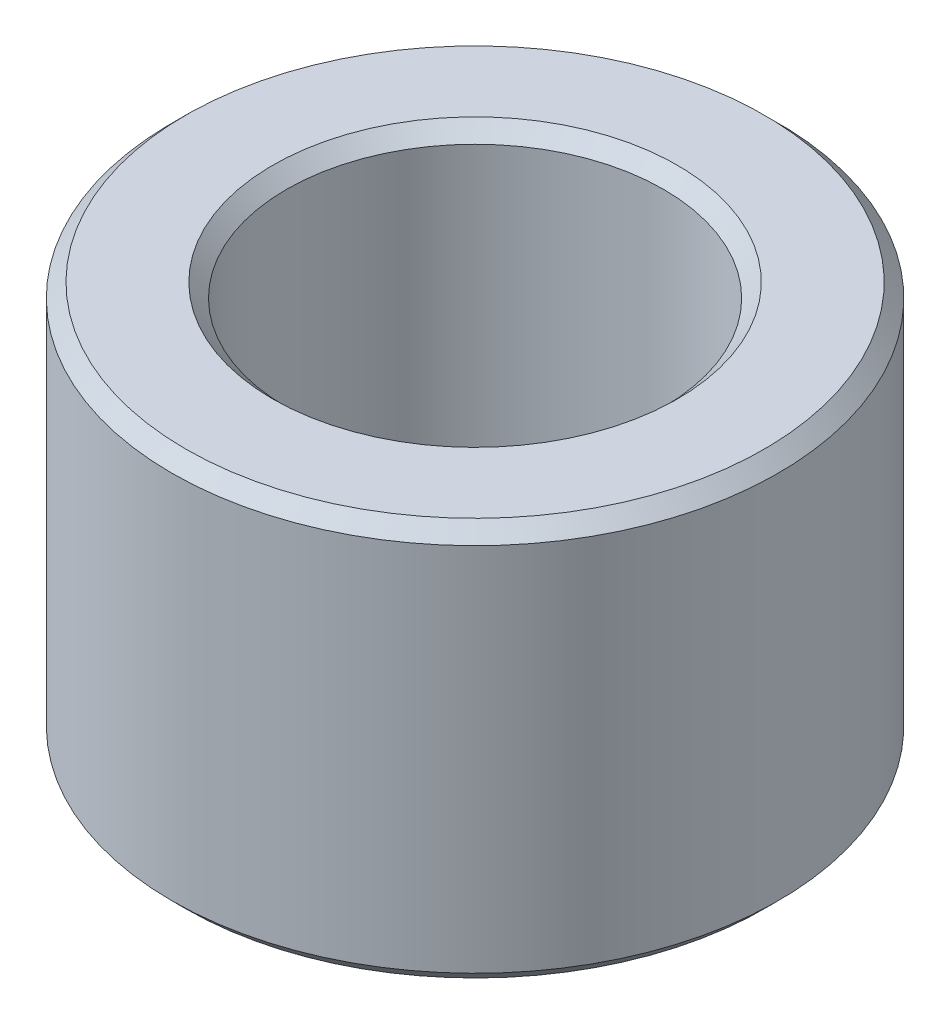
ISO-10303-21;
HEADER;
FILE_DESCRIPTION(('STEP AP214'),'2;1');
FILE_NAME('part.step','',(''),(''),'','','');
FILE_SCHEMA(('AUTOMOTIVE_DESIGN { 1 0 10303 214 1 1 1 1 }'));
ENDSEC;
DATA;
#1=APPLICATION_CONTEXT('core data for automotive mechanical design processes');
#2=APPLICATION_PROTOCOL_DEFINITION('international standard','automotive_design',2000,#1);
#3=PRODUCT_CONTEXT('',#1,'mechanical');
#4=PRODUCT('Part','Part','',(#3));
#5=PRODUCT_RELATED_PRODUCT_CATEGORY('part','',(#4));
#6=PRODUCT_DEFINITION_FORMATION('','',#4);
#7=PRODUCT_DEFINITION_CONTEXT('part definition',#1,'design');
#8=PRODUCT_DEFINITION('design','',#6,#7);
#9=PRODUCT_DEFINITION_SHAPE('','',#8);
#10=(LENGTH_UNIT() NAMED_UNIT(*) SI_UNIT(.MILLI.,.METRE.));
#11=(NAMED_UNIT(*) PLANE_ANGLE_UNIT() SI_UNIT($,.RADIAN.));
#12=(NAMED_UNIT(*) SI_UNIT($,.STERADIAN.) SOLID_ANGLE_UNIT());
#13=UNCERTAINTY_MEASURE_WITH_UNIT(LENGTH_MEASURE(1.E-05),#10,'distance_accuracy_value','');
#14=(GEOMETRIC_REPRESENTATION_CONTEXT(3) GLOBAL_UNCERTAINTY_ASSIGNED_CONTEXT((#13)) GLOBAL_UNIT_ASSIGNED_CONTEXT((#10,
#11,#12)) REPRESENTATION_CONTEXT('',''));
#15=CARTESIAN_POINT('',(0.,0.,0.));
#16=DIRECTION('',(0.,0.,1.));
#17=DIRECTION('',(1.,0.,0.));
#18=AXIS2_PLACEMENT_3D('',#15,#16,#17);
#19=CARTESIAN_POINT('',(0.,52.5242863647477,0.));
#20=DIRECTION('',(0.,-1.,0.));
#21=DIRECTION('',(0.,0.,-1.));
#22=AXIS2_PLACEMENT_3D('',#19,#20,#21);
#23=CYLINDRICAL_SURFACE('',#22,40.);
#24=CARTESIAN_POINT('',(0.,1.83390383363632,0.));
#25=DIRECTION('',(0.,1.,0.));
#26=DIRECTION('',(0.,0.,1.));
#27=AXIS2_PLACEMENT_3D('',#24,#25,#26);
#28=CIRCLE('',#27,40.);
#29=CARTESIAN_POINT('',(0.,1.83390383363632,40.));
#30=VERTEX_POINT('',#29);
#31=EDGE_CURVE('E10',#30,#30,#28,.T.);
#32=ORIENTED_EDGE('',*,*,#31,.T.);
#33=EDGE_LOOP('',(#32));
#34=FACE_BOUND('',#33,.T.);
#35=CARTESIAN_POINT('',(0.,50.6903825311114,0.));
#36=DIRECTION('',(0.,1.,0.));
#37=DIRECTION('',(0.,0.,1.));
#38=AXIS2_PLACEMENT_3D('',#35,#36,#37);
#39=CIRCLE('',#38,40.);
#40=CARTESIAN_POINT('',(0.,50.6903825311114,40.));
#41=VERTEX_POINT('',#40);
#42=EDGE_CURVE('E50',#41,#41,#39,.F.);
#43=ORIENTED_EDGE('',*,*,#42,.T.);
#44=EDGE_LOOP('',(#43));
#45=FACE_BOUND('',#44,.T.);
#46=ADVANCED_FACE('F39',(#34,#45),#23,.T.);
#47=CARTESIAN_POINT('',(0.,52.5242863647477,0.));
#48=DIRECTION('',(0.,1.,0.));
#49=DIRECTION('',(0.,0.,1.));
#50=AXIS2_PLACEMENT_3D('',#47,#48,#49);
#51=PLANE('',#50);
#52=CARTESIAN_POINT('',(0.,52.5242863647477,0.));
#53=DIRECTION('',(0.,1.,0.));
#54=DIRECTION('',(0.,0.,1.));
#55=AXIS2_PLACEMENT_3D('',#52,#53,#54);
#56=CIRCLE('',#55,26.7064048259568);
#57=CARTESIAN_POINT('',(0.,52.5242863647477,26.7064048259568));
#58=VERTEX_POINT('',#57);
#59=EDGE_CURVE('E58',#58,#58,#56,.F.);
#60=ORIENTED_EDGE('',*,*,#59,.T.);
#61=EDGE_LOOP('',(#60));
#62=FACE_BOUND('',#61,.T.);
#63=CARTESIAN_POINT('',(0.,52.5242863647477,0.));
#64=DIRECTION('',(0.,1.,0.));
#65=DIRECTION('',(0.,0.,1.));
#66=AXIS2_PLACEMENT_3D('',#63,#64,#65);
#67=CIRCLE('',#66,38.1660961663637);
#68=CARTESIAN_POINT('',(0.,52.5242863647477,38.1660961663637));
#69=VERTEX_POINT('',#68);
#70=EDGE_CURVE('E61',#69,#69,#67,.T.);
#71=ORIENTED_EDGE('',*,*,#70,.T.);
#72=EDGE_LOOP('',(#71));
#73=FACE_BOUND('',#72,.T.);
#74=ADVANCED_FACE('F88',(#62,#73),#51,.T.);
#75=CARTESIAN_POINT('',(0.,0.,0.));
#76=DIRECTION('',(0.,1.,0.));
#77=DIRECTION('',(0.,0.,1.));
#78=AXIS2_PLACEMENT_3D('',#75,#76,#77);
#79=PLANE('',#78);
#80=CARTESIAN_POINT('',(0.,0.,0.));
#81=DIRECTION('',(0.,1.,0.));
#82=DIRECTION('',(0.,0.,1.));
#83=AXIS2_PLACEMENT_3D('',#80,#81,#82);
#84=CIRCLE('',#83,26.7064048259568);
#85=CARTESIAN_POINT('',(0.,0.,-26.7064048259568));
#86=VERTEX_POINT('',#85);
#87=EDGE_CURVE('E51',#86,#86,#84,.T.);
#88=ORIENTED_EDGE('',*,*,#87,.T.);
#89=EDGE_LOOP('',(#88));
#90=FACE_BOUND('',#89,.T.);
#91=CARTESIAN_POINT('',(0.,0.,0.));
#92=DIRECTION('',(0.,1.,0.));
#93=DIRECTION('',(0.,0.,1.));
#94=AXIS2_PLACEMENT_3D('',#91,#92,#93);
#95=CIRCLE('',#94,38.1660961663637);
#96=CARTESIAN_POINT('',(0.,0.,38.1660961663637));
#97=VERTEX_POINT('',#96);
#98=EDGE_CURVE('E54',#97,#97,#95,.F.);
#99=ORIENTED_EDGE('',*,*,#98,.T.);
#100=EDGE_LOOP('',(#99));
#101=FACE_BOUND('',#100,.T.);
#102=ADVANCED_FACE('F83',(#90,#101),#79,.F.);
#103=CARTESIAN_POINT('',(0.,52.5242863647477,0.));
#104=DIRECTION('',(0.,-1.,0.));
#105=DIRECTION('',(0.,0.,-1.));
#106=AXIS2_PLACEMENT_3D('',#103,#104,#105);
#107=CYLINDRICAL_SURFACE('',#106,24.8725009923205);
#108=CARTESIAN_POINT('',(0.,50.6903825311114,0.));
#109=DIRECTION('',(0.,1.,0.));
#110=DIRECTION('',(0.,0.,1.));
#111=AXIS2_PLACEMENT_3D('',#108,#109,#110);
#112=CIRCLE('',#111,24.8725009923205);
#113=CARTESIAN_POINT('',(0.,50.6903825311114,24.8725009923205));
#114=VERTEX_POINT('',#113);
#115=EDGE_CURVE('E67',#114,#114,#112,.T.);
#116=ORIENTED_EDGE('',*,*,#115,.T.);
#117=EDGE_LOOP('',(#116));
#118=FACE_BOUND('',#117,.T.);
#119=CARTESIAN_POINT('',(0.,1.83390383363632,0.));
#120=DIRECTION('',(0.,1.,0.));
#121=DIRECTION('',(0.,0.,1.));
#122=AXIS2_PLACEMENT_3D('',#119,#120,#121);
#123=CIRCLE('',#122,24.8725009923205);
#124=CARTESIAN_POINT('',(0.,1.83390383363632,-24.8725009923205));
#125=VERTEX_POINT('',#124);
#126=EDGE_CURVE('E69',#125,#125,#123,.F.);
#127=ORIENTED_EDGE('',*,*,#126,.T.);
#128=EDGE_LOOP('',(#127));
#129=FACE_BOUND('',#128,.T.);
#130=ADVANCED_FACE('F71',(#118,#129),#107,.F.);
#131=CARTESIAN_POINT('',(0.,50.6903825311114,0.));
#132=DIRECTION('',(0.,1.,0.));
#133=DIRECTION('',(0.,0.,1.));
#134=AXIS2_PLACEMENT_3D('',#131,#132,#133);
#135=CONICAL_SURFACE('',#134,24.8725009923205,0.78539816339745);
#136=ORIENTED_EDGE('',*,*,#59,.F.);
#137=EDGE_LOOP('',(#136));
#138=FACE_BOUND('',#137,.T.);
#139=ORIENTED_EDGE('',*,*,#115,.F.);
#140=EDGE_LOOP('',(#139));
#141=FACE_BOUND('',#140,.T.);
#142=ADVANCED_FACE('F77',(#138,#141),#135,.F.);
#143=CARTESIAN_POINT('',(0.,0.,0.));
#144=DIRECTION('',(0.,-1.,0.));
#145=DIRECTION('',(0.,0.,-1.));
#146=AXIS2_PLACEMENT_3D('',#143,#144,#145);
#147=CONICAL_SURFACE('',#146,26.7064048259568,0.785398163397447);
#148=CARTESIAN_POINT('',(0.,1.83390383363632,-24.8725009923205));
#149=CARTESIAN_POINT('',(0.,1.81480066870261,-24.8916041572542));
#150=CARTESIAN_POINT('',(0.,1.7956975037689,-24.9107073221879));
#151=CARTESIAN_POINT('',(0.,1.75749117390148,-24.9489136520553));
#152=CARTESIAN_POINT('',(0.,1.73838800896777,-24.968016816989));
#153=CARTESIAN_POINT('',(0.,1.70018167910034,-25.0062231468564));
#154=CARTESIAN_POINT('',(0.,1.68107851416663,-25.0253263117901));
#155=CARTESIAN_POINT('',(0.,1.64287218429921,-25.0635326416576));
#156=CARTESIAN_POINT('',(0.,1.6237690193655,-25.0826358065913));
#157=CARTESIAN_POINT('',(0.,1.58556268949807,-25.1208421364587));
#158=CARTESIAN_POINT('',(0.,1.56645952456436,-25.1399453013924));
#159=CARTESIAN_POINT('',(0.,1.52825319469694,-25.1781516312598));
#160=CARTESIAN_POINT('',(0.,1.50915002976322,-25.1972547961936));
#161=CARTESIAN_POINT('',(0.,1.4709436998958,-25.235461126061));
#162=CARTESIAN_POINT('',(0.,1.45184053496209,-25.2545642909947));
#163=CARTESIAN_POINT('',(0.,1.41363420509467,-25.2927706208621));
#164=CARTESIAN_POINT('',(0.,1.39453104016095,-25.3118737857958));
#165=CARTESIAN_POINT('',(0.,1.35632471029353,-25.3500801156632));
#166=CARTESIAN_POINT('',(0.,1.33722154535982,-25.369183280597));
#167=CARTESIAN_POINT('',(0.,1.2990152154924,-25.4073896104644));
#168=CARTESIAN_POINT('',(0.,1.27991205055868,-25.4264927753981));
#169=CARTESIAN_POINT('',(0.,1.24170572069126,-25.4646991052655));
#170=CARTESIAN_POINT('',(0.,1.22260255575755,-25.4838022701992));
#171=CARTESIAN_POINT('',(0.,1.18439622589013,-25.5220086000667));
#172=CARTESIAN_POINT('',(0.,1.16529306095641,-25.5411117650004));
#173=CARTESIAN_POINT('',(0.,1.12708673108899,-25.5793180948678));
#174=CARTESIAN_POINT('',(0.,1.10798356615528,-25.5984212598015));
#175=CARTESIAN_POINT('',(0.,1.06977723628786,-25.6366275896689));
#176=CARTESIAN_POINT('',(0.,1.05067407135414,-25.6557307546026));
#177=CARTESIAN_POINT('',(0.,1.01246774148672,-25.6939370844701));
#178=CARTESIAN_POINT('',(0.,0.993364576553009,-25.7130402494038));
#179=CARTESIAN_POINT('',(0.,0.955158246685586,-25.7512465792712));
#180=CARTESIAN_POINT('',(0.,0.936055081751874,-25.7703497442049));
#181=CARTESIAN_POINT('',(0.,0.897848751884451,-25.8085560740723));
#182=CARTESIAN_POINT('',(0.,0.878745586950739,-25.827659239006));
#183=CARTESIAN_POINT('',(0.,0.840539257083315,-25.8658655688735));
#184=CARTESIAN_POINT('',(0.,0.821436092149603,-25.8849687338072));
#185=CARTESIAN_POINT('',(0.,0.78322976228218,-25.9231750636746));
#186=CARTESIAN_POINT('',(0.,0.764126597348469,-25.9422782286083));
#187=CARTESIAN_POINT('',(0.,0.725920267481045,-25.9804845584757));
#188=CARTESIAN_POINT('',(0.,0.706817102547333,-25.9995877234094));
#189=CARTESIAN_POINT('',(0.,0.668610772679909,-26.0377940532769));
#190=CARTESIAN_POINT('',(0.,0.649507607746198,-26.0568972182106));
#191=CARTESIAN_POINT('',(0.,0.611301277878775,-26.095103548078));
#192=CARTESIAN_POINT('',(0.,0.592198112945063,-26.1142067130117));
#193=CARTESIAN_POINT('',(0.,0.55399178307764,-26.1524130428791));
#194=CARTESIAN_POINT('',(0.,0.534888618143928,-26.1715162078129));
#195=CARTESIAN_POINT('',(0.,0.496682288276505,-26.2097225376803));
#196=CARTESIAN_POINT('',(0.,0.477579123342793,-26.228825702614));
#197=CARTESIAN_POINT('',(0.,0.439372793475369,-26.2670320324814));
#198=CARTESIAN_POINT('',(0.,0.420269628541657,-26.2861351974151));
#199=CARTESIAN_POINT('',(0.,0.382063298674234,-26.3243415272825));
#200=CARTESIAN_POINT('',(0.,0.362960133740523,-26.3434446922163));
#201=CARTESIAN_POINT('',(0.,0.324753803873099,-26.3816510220837));
#202=CARTESIAN_POINT('',(0.,0.305650638939387,-26.4007541870174));
#203=CARTESIAN_POINT('',(0.,0.267444309071964,-26.4389605168848));
#204=CARTESIAN_POINT('',(0.,0.248341144138252,-26.4580636818185));
#205=CARTESIAN_POINT('',(0.,0.210134814270829,-26.4962700116859));
#206=CARTESIAN_POINT('',(0.,0.191031649337117,-26.5153731766197));
#207=CARTESIAN_POINT('',(0.,0.152825319469694,-26.5535795064871));
#208=CARTESIAN_POINT('',(0.,0.133722154535982,-26.5726826714208));
#209=CARTESIAN_POINT('',(0.,0.0955158246685588,-26.6108890012882));
#210=CARTESIAN_POINT('',(0.,0.0764126597348468,-26.6299921662219));
#211=CARTESIAN_POINT('',(0.,0.0382063298674229,-26.6681984960893));
#212=CARTESIAN_POINT('',(0.,0.0191031649337109,-26.6873016610231));
#213=CARTESIAN_POINT('',(0.,0.,-26.7064048259568));
#214=B_SPLINE_CURVE_WITH_KNOTS('',3,(#148,#149,#150,#151,#152,#153,#154,#155,#156,#157,#158,
#159,#160,#161,#162,#163,#164,#165,#166,#167,#168,#169,#170,#171,#172,#173,#174,#175,#176,#177,
#178,#179,#180,#181,#182,#183,#184,#185,#186,#187,#188,#189,#190,#191,#192,#193,#194,#195,#196,
#197,#198,#199,#200,#201,#202,#203,#204,#205,#206,#207,#208,#209,#210,#211,#212,#213),
.UNSPECIFIED.,.F.,.F.,(4,2,2,2,2,2,2,2,2,2,2,2,2,2,2,2,2,2,2,2,2,2,2,2,2,2,2,2,2,2,2,2,4),(0.,
0.0810478648005163,0.162095729601033,0.243143594401546,0.324191459202063,0.405239324002579,
0.486287188803093,0.567335053603609,0.648382918404126,0.729430783204642,0.810478648005156,
0.891526512805672,0.972574377606189,1.0536222424067,1.13467010720722,1.21571797200773,
1.29676583680825,1.37781370160877,1.45886156640928,1.5399094312098,1.62095729601031,
1.70200516081083,1.78305302561134,1.86410089041186,1.94514875521237,2.02619662001289,
2.10724448481341,2.18829234961392,2.26934021441444,2.35038807921495,2.43143594401547,
2.51248380881598,2.5935316736165),.UNSPECIFIED.);
#215=EDGE_CURVE('BSEAM73',#125,#86,#214,.T.);
#216=ORIENTED_EDGE('',*,*,#126,.F.);
#217=ORIENTED_EDGE('',*,*,#87,.F.);
#218=ORIENTED_EDGE('',*,*,#215,.T.);
#219=ORIENTED_EDGE('',*,*,#215,.F.);
#220=EDGE_LOOP('',(#216,#218,#217,#219));
#221=FACE_BOUND('',#220,.T.);
#222=ADVANCED_FACE('F73',(#221),#147,.F.);
#223=CARTESIAN_POINT('',(0.,1.83390383363632,0.));
#224=DIRECTION('',(0.,1.,0.));
#225=DIRECTION('',(0.,0.,1.));
#226=AXIS2_PLACEMENT_3D('',#223,#224,#225);
#227=CONICAL_SURFACE('',#226,40.,0.785398163397452);
#228=CARTESIAN_POINT('',(0.,0.,38.1660961663637));
#229=CARTESIAN_POINT('',(0.,0.0191031649337115,38.1851993312974));
#230=CARTESIAN_POINT('',(0.,0.0382063298674232,38.2043024962311));
#231=CARTESIAN_POINT('',(0.,0.0764126597348466,38.2425088260985));
#232=CARTESIAN_POINT('',(0.,0.0955158246685583,38.2616119910322));
#233=CARTESIAN_POINT('',(0.,0.133722154535982,38.2998183208996));
#234=CARTESIAN_POINT('',(0.,0.152825319469693,38.3189214858334));
#235=CARTESIAN_POINT('',(0.,0.191031649337117,38.3571278157008));
#236=CARTESIAN_POINT('',(0.,0.210134814270829,38.3762309806345));
#237=CARTESIAN_POINT('',(0.,0.248341144138252,38.4144373105019));
#238=CARTESIAN_POINT('',(0.,0.267444309071964,38.4335404754356));
#239=CARTESIAN_POINT('',(0.,0.305650638939387,38.4717468053031));
#240=CARTESIAN_POINT('',(0.,0.324753803873098,38.4908499702368));
#241=CARTESIAN_POINT('',(0.,0.362960133740522,38.5290563001042));
#242=CARTESIAN_POINT('',(0.,0.382063298674234,38.5481594650379));
#243=CARTESIAN_POINT('',(0.,0.420269628541658,38.5863657949053));
#244=CARTESIAN_POINT('',(0.,0.439372793475369,38.605468959839));
#245=CARTESIAN_POINT('',(0.,0.477579123342792,38.6436752897065));
#246=CARTESIAN_POINT('',(0.,0.496682288276504,38.6627784546402));
#247=CARTESIAN_POINT('',(0.,0.534888618143928,38.7009847845076));
#248=CARTESIAN_POINT('',(0.,0.55399178307764,38.7200879494413));
#249=CARTESIAN_POINT('',(0.,0.592198112945063,38.7582942793087));
#250=CARTESIAN_POINT('',(0.,0.611301277878775,38.7773974442424));
#251=CARTESIAN_POINT('',(0.,0.649507607746198,38.8156037741099));
#252=CARTESIAN_POINT('',(0.,0.66861077267991,38.8347069390436));
#253=CARTESIAN_POINT('',(0.,0.706817102547333,38.872913268911));
#254=CARTESIAN_POINT('',(0.,0.725920267481045,38.8920164338447));
#255=CARTESIAN_POINT('',(0.,0.764126597348468,38.9302227637121));
#256=CARTESIAN_POINT('',(0.,0.78322976228218,38.9493259286458));
#257=CARTESIAN_POINT('',(0.,0.821436092149603,38.9875322585133));
#258=CARTESIAN_POINT('',(0.,0.840539257083315,39.006635423447));
#259=CARTESIAN_POINT('',(0.,0.878745586950739,39.0448417533144));
#260=CARTESIAN_POINT('',(0.,0.89784875188445,39.0639449182481));
#261=CARTESIAN_POINT('',(0.,0.936055081751874,39.1021512481155));
#262=CARTESIAN_POINT('',(0.,0.955158246685585,39.1212544130493));
#263=CARTESIAN_POINT('',(0.,0.993364576553009,39.1594607429167));
#264=CARTESIAN_POINT('',(0.,1.01246774148672,39.1785639078504));
#265=CARTESIAN_POINT('',(0.,1.05067407135414,39.2167702377178));
#266=CARTESIAN_POINT('',(0.,1.06977723628786,39.2358734026515));
#267=CARTESIAN_POINT('',(0.,1.10798356615528,39.2740797325189));
#268=CARTESIAN_POINT('',(0.,1.12708673108899,39.2931828974527));
#269=CARTESIAN_POINT('',(0.,1.16529306095641,39.3313892273201));
#270=CARTESIAN_POINT('',(0.,1.18439622589013,39.3504923922538));
#271=CARTESIAN_POINT('',(0.,1.22260255575755,39.3886987221212));
#272=CARTESIAN_POINT('',(0.,1.24170572069126,39.4078018870549));
#273=CARTESIAN_POINT('',(0.,1.27991205055868,39.4460082169224));
#274=CARTESIAN_POINT('',(0.,1.2990152154924,39.4651113818561));
#275=CARTESIAN_POINT('',(0.,1.33722154535982,39.5033177117235));
#276=CARTESIAN_POINT('',(0.,1.35632471029353,39.5224208766572));
#277=CARTESIAN_POINT('',(0.,1.39453104016096,39.5606272065246));
#278=CARTESIAN_POINT('',(0.,1.41363420509467,39.5797303714583));
#279=CARTESIAN_POINT('',(0.,1.45184053496209,39.6179367013258));
#280=CARTESIAN_POINT('',(0.,1.4709436998958,39.6370398662595));
#281=CARTESIAN_POINT('',(0.,1.50915002976323,39.6752461961269));
#282=CARTESIAN_POINT('',(0.,1.52825319469694,39.6943493610606));
#283=CARTESIAN_POINT('',(0.,1.56645952456436,39.732555690928));
#284=CARTESIAN_POINT('',(0.,1.58556268949807,39.7516588558617));
#285=CARTESIAN_POINT('',(0.,1.6237690193655,39.7898651857292));
#286=CARTESIAN_POINT('',(0.,1.64287218429921,39.8089683506629));
#287=CARTESIAN_POINT('',(0.,1.68107851416663,39.8471746805303));
#288=CARTESIAN_POINT('',(0.,1.70018167910034,39.866277845464));
#289=CARTESIAN_POINT('',(0.,1.73838800896777,39.9044841753314));
#290=CARTESIAN_POINT('',(0.,1.75749117390148,39.9235873402652));
#291=CARTESIAN_POINT('',(0.,1.7956975037689,39.9617936701326));
#292=CARTESIAN_POINT('',(0.,1.81480066870261,39.9808968350663));
#293=CARTESIAN_POINT('',(0.,1.83390383363632,40.));
#294=B_SPLINE_CURVE_WITH_KNOTS('',3,(#228,#229,#230,#231,#232,#233,#234,#235,#236,#237,#238,
#239,#240,#241,#242,#243,#244,#245,#246,#247,#248,#249,#250,#251,#252,#253,#254,#255,#256,#257,
#258,#259,#260,#261,#262,#263,#264,#265,#266,#267,#268,#269,#270,#271,#272,#273,#274,#275,#276,
#277,#278,#279,#280,#281,#282,#283,#284,#285,#286,#287,#288,#289,#290,#291,#292,#293),
.UNSPECIFIED.,.F.,.F.,(4,2,2,2,2,2,2,2,2,2,2,2,2,2,2,2,2,2,2,2,2,2,2,2,2,2,2,2,2,2,2,2,4),(0.,
0.0810478648005163,0.162095729601033,0.243143594401549,0.324191459202065,0.405239324002582,
0.486287188803098,0.567335053603609,0.648382918404126,0.729430783204642,0.810478648005158,
0.891526512805675,0.972574377606191,1.05362224240671,1.13467010720722,1.21571797200774,
1.29676583680826,1.37781370160877,1.45886156640929,1.5399094312098,1.62095729601032,
1.70200516081084,1.78305302561135,1.86410089041187,1.94514875521238,2.0261966200129,
2.10724448481341,2.18829234961393,2.26934021441445,2.35038807921496,2.43143594401548,
2.512483808816,2.59353167361651),.UNSPECIFIED.);
#295=EDGE_CURVE('BSEAM76',#97,#30,#294,.T.);
#296=ORIENTED_EDGE('',*,*,#98,.F.);
#297=ORIENTED_EDGE('',*,*,#31,.F.);
#298=ORIENTED_EDGE('',*,*,#295,.T.);
#299=ORIENTED_EDGE('',*,*,#295,.F.);
#300=EDGE_LOOP('',(#296,#298,#297,#299));
#301=FACE_BOUND('',#300,.T.);
#302=ADVANCED_FACE('F76',(#301),#227,.T.);
#303=CARTESIAN_POINT('',(0.,52.5242863647477,0.));
#304=DIRECTION('',(0.,-1.,0.));
#305=DIRECTION('',(0.,0.,-1.));
#306=AXIS2_PLACEMENT_3D('',#303,#304,#305);
#307=CONICAL_SURFACE('',#306,38.1660961663637,0.785398163397439);
#308=ORIENTED_EDGE('',*,*,#42,.F.);
#309=EDGE_LOOP('',(#308));
#310=FACE_BOUND('',#309,.T.);
#311=ORIENTED_EDGE('',*,*,#70,.F.);
#312=EDGE_LOOP('',(#311));
#313=FACE_BOUND('',#312,.T.);
#314=ADVANCED_FACE('F45',(#310,#313),#307,.T.);
#315=CLOSED_SHELL('',(#46,#74,#102,#130,#142,#222,#302,#314));
#316=MANIFOLD_SOLID_BREP('B2',#315);
#317=ADVANCED_BREP_SHAPE_REPRESENTATION('',(#18,#316),#14);
#318=SHAPE_DEFINITION_REPRESENTATION(#9,#317);
ENDSEC;
END-ISO-10303-21;
